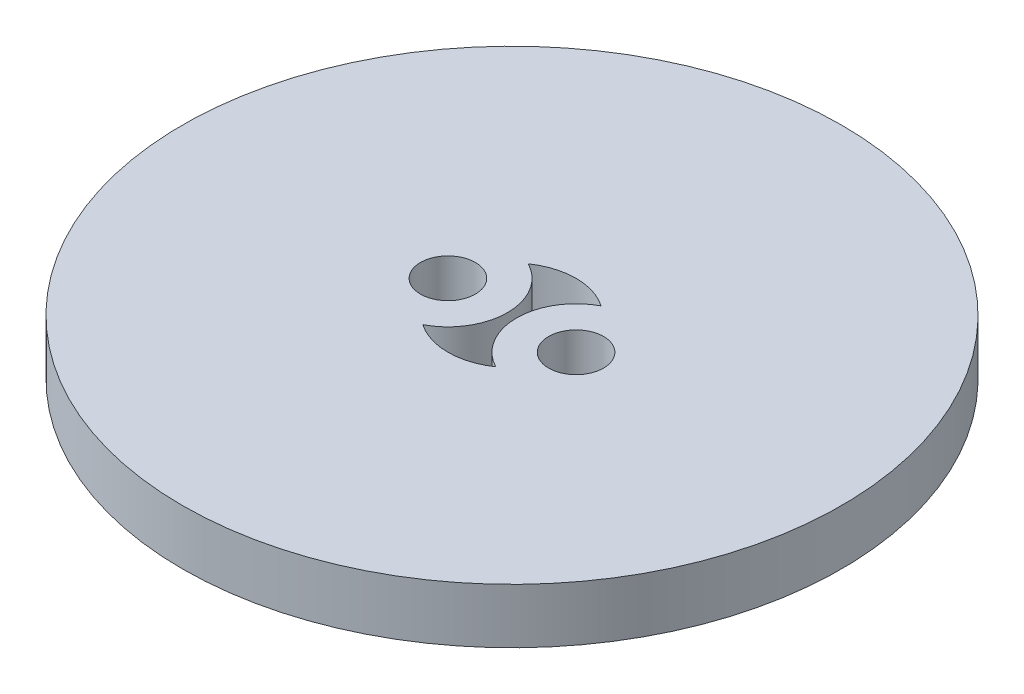
ISO-10303-21;
HEADER;
FILE_DESCRIPTION(('STEP AP214'),'2;1');
FILE_NAME('part.step','',(''),(''),'','','');
FILE_SCHEMA(('AUTOMOTIVE_DESIGN { 1 0 10303 214 1 1 1 1 }'));
ENDSEC;
DATA;
#1=APPLICATION_CONTEXT('core data for automotive mechanical design processes');
#2=APPLICATION_PROTOCOL_DEFINITION('international standard','automotive_design',2000,#1);
#3=PRODUCT_CONTEXT('',#1,'mechanical');
#4=PRODUCT('Part','Part','',(#3));
#5=PRODUCT_RELATED_PRODUCT_CATEGORY('part','',(#4));
#6=PRODUCT_DEFINITION_FORMATION('','',#4);
#7=PRODUCT_DEFINITION_CONTEXT('part definition',#1,'design');
#8=PRODUCT_DEFINITION('design','',#6,#7);
#9=PRODUCT_DEFINITION_SHAPE('','',#8);
#10=(LENGTH_UNIT() NAMED_UNIT(*) SI_UNIT(.MILLI.,.METRE.));
#11=(NAMED_UNIT(*) PLANE_ANGLE_UNIT() SI_UNIT($,.RADIAN.));
#12=(NAMED_UNIT(*) SI_UNIT($,.STERADIAN.) SOLID_ANGLE_UNIT());
#13=UNCERTAINTY_MEASURE_WITH_UNIT(LENGTH_MEASURE(1.E-05),#10,'distance_accuracy_value','');
#14=(GEOMETRIC_REPRESENTATION_CONTEXT(3) GLOBAL_UNCERTAINTY_ASSIGNED_CONTEXT((#13)) GLOBAL_UNIT_ASSIGNED_CONTEXT((#10,
#11,#12)) REPRESENTATION_CONTEXT('',''));
#15=CARTESIAN_POINT('',(0.,0.,0.));
#16=DIRECTION('',(0.,0.,1.));
#17=DIRECTION('',(1.,0.,0.));
#18=AXIS2_PLACEMENT_3D('',#15,#16,#17);
#19=CARTESIAN_POINT('',(0.,3.,0.));
#20=DIRECTION('',(0.,1.,0.));
#21=DIRECTION('',(0.,0.,1.));
#22=AXIS2_PLACEMENT_3D('',#19,#20,#21);
#23=PLANE('',#22);
#24=CARTESIAN_POINT('',(-3.5,3.,0.));
#25=DIRECTION('',(0.,1.,0.));
#26=DIRECTION('',(0.,0.,1.));
#27=AXIS2_PLACEMENT_3D('',#24,#25,#26);
#28=CIRCLE('',#27,1.5);
#29=CARTESIAN_POINT('',(-3.5,3.,1.5));
#30=VERTEX_POINT('',#29);
#31=EDGE_CURVE('E116',#30,#30,#28,.T.);
#32=ORIENTED_EDGE('',*,*,#31,.F.);
#33=EDGE_LOOP('',(#32));
#34=FACE_BOUND('',#33,.T.);
#35=CARTESIAN_POINT('',(0.,3.,0.));
#36=DIRECTION('',(0.,1.,0.));
#37=DIRECTION('',(0.,0.,1.));
#38=AXIS2_PLACEMENT_3D('',#35,#36,#37);
#39=CIRCLE('',#38,18.);
#40=CARTESIAN_POINT('',(0.,3.,18.));
#41=VERTEX_POINT('',#40);
#42=EDGE_CURVE('E11',#41,#41,#39,.T.);
#43=ORIENTED_EDGE('',*,*,#42,.T.);
#44=EDGE_LOOP('',(#43));
#45=FACE_BOUND('',#44,.T.);
#46=CARTESIAN_POINT('',(3.5,3.,0.));
#47=DIRECTION('',(0.,1.,0.));
#48=DIRECTION('',(0.,0.,1.));
#49=AXIS2_PLACEMENT_3D('',#46,#47,#48);
#50=CIRCLE('',#49,1.5);
#51=CARTESIAN_POINT('',(3.5,3.,1.5));
#52=VERTEX_POINT('',#51);
#53=EDGE_CURVE('E110',#52,#52,#50,.T.);
#54=ORIENTED_EDGE('',*,*,#53,.F.);
#55=EDGE_LOOP('',(#54));
#56=FACE_BOUND('',#55,.T.);
#57=CARTESIAN_POINT('',(-3.5,3.,0.));
#58=DIRECTION('',(0.,-1.,0.));
#59=DIRECTION('',(0.,0.,1.));
#60=AXIS2_PLACEMENT_3D('',#57,#58,#59);
#61=CIRCLE('',#60,3.25);
#62=CARTESIAN_POINT('',(-1.99107142857143,3.,-2.87847782105865));
#63=VERTEX_POINT('',#62);
#64=CARTESIAN_POINT('',(-1.99107142857143,3.,2.87847782105865));
#65=VERTEX_POINT('',#64);
#66=EDGE_CURVE('E82',#63,#65,#61,.T.);
#67=ORIENTED_EDGE('',*,*,#66,.F.);
#68=CARTESIAN_POINT('',(0.,3.,0.));
#69=DIRECTION('',(0.,1.,0.));
#70=DIRECTION('',(0.,0.,1.));
#71=AXIS2_PLACEMENT_3D('',#68,#69,#70);
#72=CIRCLE('',#71,3.5);
#73=CARTESIAN_POINT('',(1.99107142857143,3.,-2.87847782105865));
#74=VERTEX_POINT('',#73);
#75=EDGE_CURVE('E74',#74,#63,#72,.T.);
#76=ORIENTED_EDGE('',*,*,#75,.F.);
#77=CARTESIAN_POINT('',(3.5,3.,0.));
#78=DIRECTION('',(0.,-1.,0.));
#79=DIRECTION('',(0.,0.,1.));
#80=AXIS2_PLACEMENT_3D('',#77,#78,#79);
#81=CIRCLE('',#80,3.25);
#82=CARTESIAN_POINT('',(1.99107142857143,3.,2.87847782105865));
#83=VERTEX_POINT('',#82);
#84=EDGE_CURVE('E96',#83,#74,#81,.T.);
#85=ORIENTED_EDGE('',*,*,#84,.F.);
#86=CARTESIAN_POINT('',(0.,3.,0.));
#87=DIRECTION('',(0.,1.,0.));
#88=DIRECTION('',(0.,0.,1.));
#89=AXIS2_PLACEMENT_3D('',#86,#87,#88);
#90=CIRCLE('',#89,3.5);
#91=EDGE_CURVE('E94',#65,#83,#90,.T.);
#92=ORIENTED_EDGE('',*,*,#91,.F.);
#93=EDGE_LOOP('',(#67,#76,#85,#92));
#94=FACE_BOUND('',#93,.T.);
#95=ADVANCED_FACE('F33',(#34,#45,#56,#94),#23,.T.);
#96=CARTESIAN_POINT('',(0.,0.,0.));
#97=DIRECTION('',(0.,1.,0.));
#98=DIRECTION('',(0.,0.,1.));
#99=AXIS2_PLACEMENT_3D('',#96,#97,#98);
#100=PLANE('',#99);
#101=CARTESIAN_POINT('',(3.5,0.,0.));
#102=DIRECTION('',(0.,1.,0.));
#103=DIRECTION('',(0.,0.,1.));
#104=AXIS2_PLACEMENT_3D('',#101,#102,#103);
#105=CIRCLE('',#104,1.5);
#106=CARTESIAN_POINT('',(3.5,0.,1.5));
#107=VERTEX_POINT('',#106);
#108=EDGE_CURVE('E90',#107,#107,#105,.T.);
#109=ORIENTED_EDGE('',*,*,#108,.T.);
#110=EDGE_LOOP('',(#109));
#111=FACE_BOUND('',#110,.T.);
#112=CARTESIAN_POINT('',(-3.5,0.,0.));
#113=DIRECTION('',(0.,1.,0.));
#114=DIRECTION('',(0.,0.,1.));
#115=AXIS2_PLACEMENT_3D('',#112,#113,#114);
#116=CIRCLE('',#115,1.5);
#117=CARTESIAN_POINT('',(-3.5,0.,1.5));
#118=VERTEX_POINT('',#117);
#119=EDGE_CURVE('E113',#118,#118,#116,.T.);
#120=ORIENTED_EDGE('',*,*,#119,.T.);
#121=EDGE_LOOP('',(#120));
#122=FACE_BOUND('',#121,.T.);
#123=CARTESIAN_POINT('',(0.,0.,0.));
#124=DIRECTION('',(0.,1.,0.));
#125=DIRECTION('',(0.,0.,1.));
#126=AXIS2_PLACEMENT_3D('',#123,#124,#125);
#127=CIRCLE('',#126,18.);
#128=CARTESIAN_POINT('',(0.,0.,18.));
#129=VERTEX_POINT('',#128);
#130=EDGE_CURVE('E37',#129,#129,#127,.T.);
#131=ORIENTED_EDGE('',*,*,#130,.F.);
#132=EDGE_LOOP('',(#131));
#133=FACE_BOUND('',#132,.T.);
#134=CARTESIAN_POINT('',(0.,0.,0.));
#135=DIRECTION('',(0.,1.,0.));
#136=DIRECTION('',(0.,0.,1.));
#137=AXIS2_PLACEMENT_3D('',#134,#135,#136);
#138=CIRCLE('',#137,3.5);
#139=CARTESIAN_POINT('',(1.99107142857143,0.,-2.87847782105865));
#140=VERTEX_POINT('',#139);
#141=CARTESIAN_POINT('',(-1.99107142857143,0.,-2.87847782105865));
#142=VERTEX_POINT('',#141);
#143=EDGE_CURVE('E56',#140,#142,#138,.T.);
#144=ORIENTED_EDGE('',*,*,#143,.T.);
#145=CARTESIAN_POINT('',(-3.5,0.,0.));
#146=DIRECTION('',(0.,-1.,0.));
#147=DIRECTION('',(0.,0.,1.));
#148=AXIS2_PLACEMENT_3D('',#145,#146,#147);
#149=CIRCLE('',#148,3.25);
#150=CARTESIAN_POINT('',(-1.99107142857143,0.,2.87847782105865));
#151=VERTEX_POINT('',#150);
#152=EDGE_CURVE('E89',#142,#151,#149,.T.);
#153=ORIENTED_EDGE('',*,*,#152,.T.);
#154=CARTESIAN_POINT('',(0.,0.,0.));
#155=DIRECTION('',(0.,1.,0.));
#156=DIRECTION('',(0.,0.,1.));
#157=AXIS2_PLACEMENT_3D('',#154,#155,#156);
#158=CIRCLE('',#157,3.5);
#159=CARTESIAN_POINT('',(1.99107142857143,0.,2.87847782105865));
#160=VERTEX_POINT('',#159);
#161=EDGE_CURVE('E102',#151,#160,#158,.T.);
#162=ORIENTED_EDGE('',*,*,#161,.T.);
#163=CARTESIAN_POINT('',(3.5,0.,0.));
#164=DIRECTION('',(0.,-1.,0.));
#165=DIRECTION('',(0.,0.,1.));
#166=AXIS2_PLACEMENT_3D('',#163,#164,#165);
#167=CIRCLE('',#166,3.25);
#168=EDGE_CURVE('E83',#160,#140,#167,.T.);
#169=ORIENTED_EDGE('',*,*,#168,.T.);
#170=EDGE_LOOP('',(#144,#153,#162,#169));
#171=FACE_BOUND('',#170,.T.);
#172=ADVANCED_FACE('F122',(#111,#122,#133,#171),#100,.F.);
#173=CARTESIAN_POINT('',(0.,3.,0.));
#174=DIRECTION('',(0.,-1.,0.));
#175=DIRECTION('',(0.,0.,-1.));
#176=AXIS2_PLACEMENT_3D('',#173,#174,#175);
#177=CYLINDRICAL_SURFACE('',#176,18.);
#178=ORIENTED_EDGE('',*,*,#42,.F.);
#179=EDGE_LOOP('',(#178));
#180=FACE_BOUND('',#179,.T.);
#181=ORIENTED_EDGE('',*,*,#130,.T.);
#182=EDGE_LOOP('',(#181));
#183=FACE_BOUND('',#182,.T.);
#184=ADVANCED_FACE('F35',(#180,#183),#177,.T.);
#185=CARTESIAN_POINT('',(-3.5,3.,0.));
#186=DIRECTION('',(0.,-1.,0.));
#187=DIRECTION('',(0.,0.,-1.));
#188=AXIS2_PLACEMENT_3D('',#185,#186,#187);
#189=CYLINDRICAL_SURFACE('',#188,1.5);
#190=ORIENTED_EDGE('',*,*,#31,.T.);
#191=EDGE_LOOP('',(#190));
#192=FACE_BOUND('',#191,.T.);
#193=ORIENTED_EDGE('',*,*,#119,.F.);
#194=EDGE_LOOP('',(#193));
#195=FACE_BOUND('',#194,.T.);
#196=ADVANCED_FACE('F125',(#192,#195),#189,.F.);
#197=CARTESIAN_POINT('',(3.5,3.,0.));
#198=DIRECTION('',(0.,-1.,0.));
#199=DIRECTION('',(0.,0.,-1.));
#200=AXIS2_PLACEMENT_3D('',#197,#198,#199);
#201=CYLINDRICAL_SURFACE('',#200,1.5);
#202=ORIENTED_EDGE('',*,*,#53,.T.);
#203=EDGE_LOOP('',(#202));
#204=FACE_BOUND('',#203,.T.);
#205=ORIENTED_EDGE('',*,*,#108,.F.);
#206=EDGE_LOOP('',(#205));
#207=FACE_BOUND('',#206,.T.);
#208=ADVANCED_FACE('F127',(#204,#207),#201,.F.);
#209=CARTESIAN_POINT('',(0.,3.,0.));
#210=DIRECTION('',(0.,-1.,0.));
#211=DIRECTION('',(0.,0.,-1.));
#212=AXIS2_PLACEMENT_3D('',#209,#210,#211);
#213=CYLINDRICAL_SURFACE('',#212,3.5);
#214=ORIENTED_EDGE('',*,*,#143,.F.);
#215=DIRECTION('',(0.,-1.,0.));
#216=VECTOR('',#215,1.);
#217=CARTESIAN_POINT('',(1.99107142857143,3.,-2.87847782105865));
#218=LINE('',#217,#216);
#219=EDGE_CURVE('E78',#74,#140,#218,.T.);
#220=ORIENTED_EDGE('',*,*,#219,.F.);
#221=ORIENTED_EDGE('',*,*,#75,.T.);
#222=DIRECTION('',(0.,-1.,0.));
#223=VECTOR('',#222,1.);
#224=CARTESIAN_POINT('',(-1.99107142857143,3.,-2.87847782105865));
#225=LINE('',#224,#223);
#226=EDGE_CURVE('E77',#63,#142,#225,.T.);
#227=ORIENTED_EDGE('',*,*,#226,.T.);
#228=EDGE_LOOP('',(#214,#220,#221,#227));
#229=FACE_BOUND('',#228,.T.);
#230=ADVANCED_FACE('F76',(#229),#213,.F.);
#231=CARTESIAN_POINT('',(-3.5,3.,0.));
#232=DIRECTION('',(0.,-1.,0.));
#233=DIRECTION('',(0.,0.,-1.));
#234=AXIS2_PLACEMENT_3D('',#231,#232,#233);
#235=CYLINDRICAL_SURFACE('',#234,3.25);
#236=ORIENTED_EDGE('',*,*,#152,.F.);
#237=ORIENTED_EDGE('',*,*,#226,.F.);
#238=ORIENTED_EDGE('',*,*,#66,.T.);
#239=DIRECTION('',(0.,-1.,0.));
#240=VECTOR('',#239,1.);
#241=CARTESIAN_POINT('',(-1.99107142857143,3.,2.87847782105865));
#242=LINE('',#241,#240);
#243=EDGE_CURVE('E91',#65,#151,#242,.T.);
#244=ORIENTED_EDGE('',*,*,#243,.T.);
#245=EDGE_LOOP('',(#236,#237,#238,#244));
#246=FACE_BOUND('',#245,.T.);
#247=ADVANCED_FACE('F86',(#246),#235,.T.);
#248=CARTESIAN_POINT('',(0.,3.,0.));
#249=DIRECTION('',(0.,-1.,0.));
#250=DIRECTION('',(0.,0.,-1.));
#251=AXIS2_PLACEMENT_3D('',#248,#249,#250);
#252=CYLINDRICAL_SURFACE('',#251,3.5);
#253=ORIENTED_EDGE('',*,*,#161,.F.);
#254=ORIENTED_EDGE('',*,*,#243,.F.);
#255=ORIENTED_EDGE('',*,*,#91,.T.);
#256=DIRECTION('',(0.,-1.,0.));
#257=VECTOR('',#256,1.);
#258=CARTESIAN_POINT('',(1.99107142857143,3.,2.87847782105865));
#259=LINE('',#258,#257);
#260=EDGE_CURVE('E48',#83,#160,#259,.T.);
#261=ORIENTED_EDGE('',*,*,#260,.T.);
#262=EDGE_LOOP('',(#253,#254,#255,#261));
#263=FACE_BOUND('',#262,.T.);
#264=ADVANCED_FACE('F158',(#263),#252,.F.);
#265=CARTESIAN_POINT('',(3.5,3.,0.));
#266=DIRECTION('',(0.,-1.,0.));
#267=DIRECTION('',(0.,0.,-1.));
#268=AXIS2_PLACEMENT_3D('',#265,#266,#267);
#269=CYLINDRICAL_SURFACE('',#268,3.25);
#270=ORIENTED_EDGE('',*,*,#168,.F.);
#271=ORIENTED_EDGE('',*,*,#260,.F.);
#272=ORIENTED_EDGE('',*,*,#84,.T.);
#273=ORIENTED_EDGE('',*,*,#219,.T.);
#274=EDGE_LOOP('',(#270,#271,#272,#273));
#275=FACE_BOUND('',#274,.T.);
#276=ADVANCED_FACE('F156',(#275),#269,.T.);
#277=CLOSED_SHELL('',(#95,#172,#184,#196,#208,#230,#247,#264,#276));
#278=MANIFOLD_SOLID_BREP('B2',#277);
#279=ADVANCED_BREP_SHAPE_REPRESENTATION('',(#18,#278),#14);
#280=SHAPE_DEFINITION_REPRESENTATION(#9,#279);
ENDSEC;
END-ISO-10303-21;
